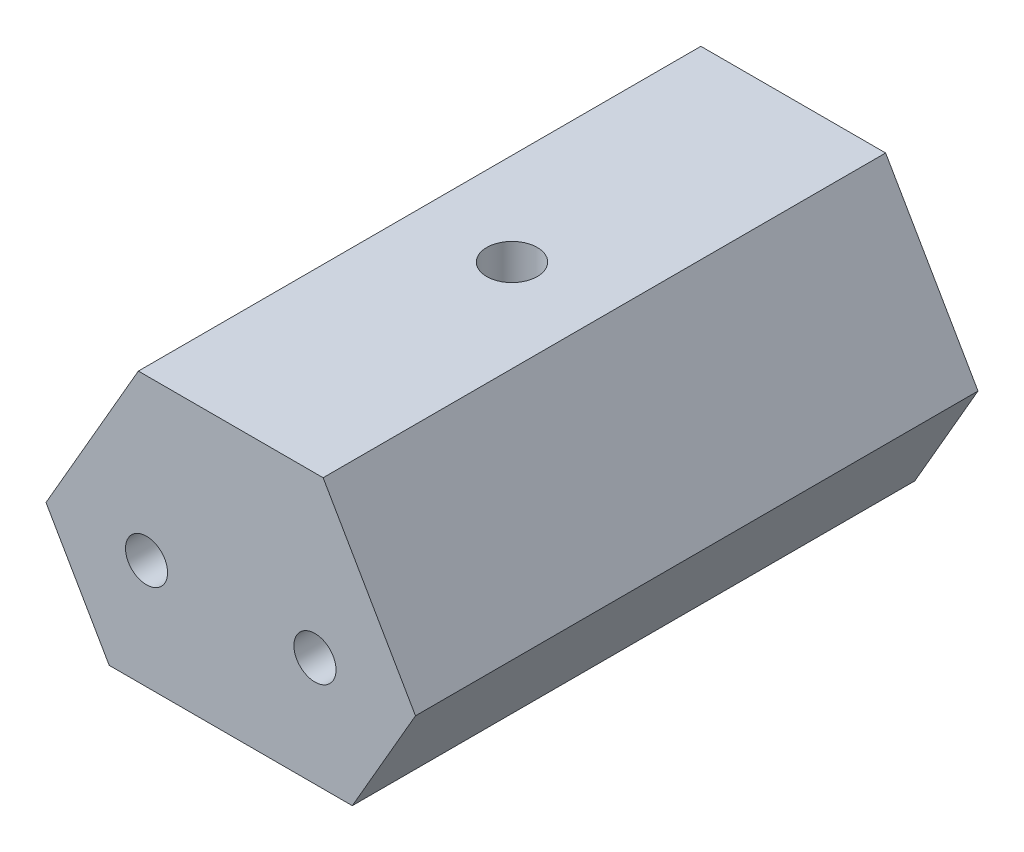
ISO-10303-21;
HEADER;
FILE_DESCRIPTION(('STEP AP214'),'2;1');
FILE_NAME('part.step','',(''),(''),'','','');
FILE_SCHEMA(('AUTOMOTIVE_DESIGN { 1 0 10303 214 1 1 1 1 }'));
ENDSEC;
DATA;
#1=APPLICATION_CONTEXT('core data for automotive mechanical design processes');
#2=APPLICATION_PROTOCOL_DEFINITION('international standard','automotive_design',2000,#1);
#3=PRODUCT_CONTEXT('',#1,'mechanical');
#4=PRODUCT('Part','Part','',(#3));
#5=PRODUCT_RELATED_PRODUCT_CATEGORY('part','',(#4));
#6=PRODUCT_DEFINITION_FORMATION('','',#4);
#7=PRODUCT_DEFINITION_CONTEXT('part definition',#1,'design');
#8=PRODUCT_DEFINITION('design','',#6,#7);
#9=PRODUCT_DEFINITION_SHAPE('','',#8);
#10=(LENGTH_UNIT() NAMED_UNIT(*) SI_UNIT(.MILLI.,.METRE.));
#11=(NAMED_UNIT(*) PLANE_ANGLE_UNIT() SI_UNIT($,.RADIAN.));
#12=(NAMED_UNIT(*) SI_UNIT($,.STERADIAN.) SOLID_ANGLE_UNIT());
#13=UNCERTAINTY_MEASURE_WITH_UNIT(LENGTH_MEASURE(1.E-05),#10,'distance_accuracy_value','');
#14=(GEOMETRIC_REPRESENTATION_CONTEXT(3) GLOBAL_UNCERTAINTY_ASSIGNED_CONTEXT((#13)) GLOBAL_UNIT_ASSIGNED_CONTEXT((#10,
#11,#12)) REPRESENTATION_CONTEXT('',''));
#15=CARTESIAN_POINT('',(0.,0.,0.));
#16=DIRECTION('',(0.,0.,1.));
#17=DIRECTION('',(1.,0.,0.));
#18=AXIS2_PLACEMENT_3D('',#15,#16,#17);
#19=CARTESIAN_POINT('',(5.48482755730145,9.5,16.7));
#20=DIRECTION('',(0.,-1.,0.));
#21=DIRECTION('',(1.,0.,0.));
#22=AXIS2_PLACEMENT_3D('',#19,#20,#21);
#23=PLANE('',#22);
#24=DIRECTION('',(-1.,0.,0.));
#25=VECTOR('',#24,1.);
#26=CARTESIAN_POINT('',(5.48482755730145,9.5,-16.7));
#27=LINE('',#26,#25);
#28=CARTESIAN_POINT('',(5.48482755730145,9.5,-16.7));
#29=VERTEX_POINT('',#28);
#30=CARTESIAN_POINT('',(-5.48482755730144,9.5,-16.7));
#31=VERTEX_POINT('',#30);
#32=EDGE_CURVE('E144',#29,#31,#27,.T.);
#33=ORIENTED_EDGE('',*,*,#32,.T.);
#34=DIRECTION('',(0.,0.,-1.));
#35=VECTOR('',#34,1.);
#36=CARTESIAN_POINT('',(-5.48482755730144,9.5,16.7));
#37=LINE('',#36,#35);
#38=CARTESIAN_POINT('',(-5.48482755730144,9.5,16.7));
#39=VERTEX_POINT('',#38);
#40=EDGE_CURVE('E59',#39,#31,#37,.T.);
#41=ORIENTED_EDGE('',*,*,#40,.F.);
#42=DIRECTION('',(-1.,0.,0.));
#43=VECTOR('',#42,1.);
#44=CARTESIAN_POINT('',(5.48482755730145,9.5,16.7));
#45=LINE('',#44,#43);
#46=CARTESIAN_POINT('',(5.48482755730145,9.5,16.7));
#47=VERTEX_POINT('',#46);
#48=EDGE_CURVE('E104',#47,#39,#45,.T.);
#49=ORIENTED_EDGE('',*,*,#48,.F.);
#50=DIRECTION('',(0.,0.,-1.));
#51=VECTOR('',#50,1.);
#52=CARTESIAN_POINT('',(5.48482755730145,9.5,16.7));
#53=LINE('',#52,#51);
#54=EDGE_CURVE('E11',#47,#29,#53,.T.);
#55=ORIENTED_EDGE('',*,*,#54,.T.);
#56=EDGE_LOOP('',(#33,#41,#49,#55));
#57=FACE_BOUND('',#56,.T.);
#58=CARTESIAN_POINT('',(0.,9.5,0.));
#59=DIRECTION('',(0.,1.,0.));
#60=DIRECTION('',(0.,0.,1.));
#61=AXIS2_PLACEMENT_3D('',#58,#59,#60);
#62=CIRCLE('',#61,1.5);
#63=CARTESIAN_POINT('',(0.,9.5,1.5));
#64=VERTEX_POINT('',#63);
#65=EDGE_CURVE('E281',#64,#64,#62,.T.);
#66=ORIENTED_EDGE('',*,*,#65,.F.);
#67=EDGE_LOOP('',(#66));
#68=FACE_BOUND('',#67,.T.);
#69=ADVANCED_FACE('F49',(#57,#68),#23,.F.);
#70=CARTESIAN_POINT('',(0.,0.,16.7));
#71=DIRECTION('',(0.,0.,1.));
#72=DIRECTION('',(1.,0.,0.));
#73=AXIS2_PLACEMENT_3D('',#70,#71,#72);
#74=PLANE('',#73);
#75=CARTESIAN_POINT('',(-5.,0.,16.7));
#76=DIRECTION('',(0.,0.,1.));
#77=DIRECTION('',(1.,0.,0.));
#78=AXIS2_PLACEMENT_3D('',#75,#76,#77);
#79=CIRCLE('',#78,1.25);
#80=CARTESIAN_POINT('',(-3.75,0.,16.7));
#81=VERTEX_POINT('',#80);
#82=EDGE_CURVE('E145',#81,#81,#79,.T.);
#83=ORIENTED_EDGE('',*,*,#82,.F.);
#84=EDGE_LOOP('',(#83));
#85=FACE_BOUND('',#84,.T.);
#86=DIRECTION('',(-0.5,0.866025403784439,0.));
#87=VECTOR('',#86,1.);
#88=CARTESIAN_POINT('',(10.9696551146029,0.,16.7));
#89=LINE('',#88,#87);
#90=CARTESIAN_POINT('',(10.9696551146029,0.,16.7));
#91=VERTEX_POINT('',#90);
#92=EDGE_CURVE('E157',#91,#47,#89,.T.);
#93=ORIENTED_EDGE('',*,*,#92,.T.);
#94=ORIENTED_EDGE('',*,*,#48,.T.);
#95=DIRECTION('',(-0.5,-0.866025403784439,0.));
#96=VECTOR('',#95,1.);
#97=CARTESIAN_POINT('',(-5.48482755730144,9.5,16.7));
#98=LINE('',#97,#96);
#99=CARTESIAN_POINT('',(-10.9696551146029,0.,16.7));
#100=VERTEX_POINT('',#99);
#101=EDGE_CURVE('E118',#39,#100,#98,.T.);
#102=ORIENTED_EDGE('',*,*,#101,.T.);
#103=DIRECTION('',(0.5,-0.866025403784439,0.));
#104=VECTOR('',#103,1.);
#105=CARTESIAN_POINT('',(-10.9696551146029,0.,16.7));
#106=LINE('',#105,#104);
#107=CARTESIAN_POINT('',(-7.21687836487032,-6.5,16.7));
#108=VERTEX_POINT('',#107);
#109=EDGE_CURVE('E111',#100,#108,#106,.T.);
#110=ORIENTED_EDGE('',*,*,#109,.T.);
#111=DIRECTION('',(1.,0.,0.));
#112=VECTOR('',#111,1.);
#113=CARTESIAN_POINT('',(-7.21687836487032,-6.5,16.7));
#114=LINE('',#113,#112);
#115=CARTESIAN_POINT('',(7.21687836487032,-6.5,16.7));
#116=VERTEX_POINT('',#115);
#117=EDGE_CURVE('E116',#108,#116,#114,.T.);
#118=ORIENTED_EDGE('',*,*,#117,.T.);
#119=DIRECTION('',(0.5,0.866025403784438,0.));
#120=VECTOR('',#119,1.);
#121=CARTESIAN_POINT('',(7.21687836487032,-6.5,16.7));
#122=LINE('',#121,#120);
#123=EDGE_CURVE('E67',#116,#91,#122,.T.);
#124=ORIENTED_EDGE('',*,*,#123,.T.);
#125=EDGE_LOOP('',(#93,#94,#102,#110,#118,#124));
#126=FACE_BOUND('',#125,.T.);
#127=CARTESIAN_POINT('',(5.,0.,16.7));
#128=DIRECTION('',(0.,0.,1.));
#129=DIRECTION('',(1.,0.,0.));
#130=AXIS2_PLACEMENT_3D('',#127,#128,#129);
#131=CIRCLE('',#130,1.25);
#132=CARTESIAN_POINT('',(6.25,0.,16.7));
#133=VERTEX_POINT('',#132);
#134=EDGE_CURVE('E288',#133,#133,#131,.T.);
#135=ORIENTED_EDGE('',*,*,#134,.F.);
#136=EDGE_LOOP('',(#135));
#137=FACE_BOUND('',#136,.T.);
#138=ADVANCED_FACE('F113',(#85,#126,#137),#74,.T.);
#139=CARTESIAN_POINT('',(0.,0.,-16.7));
#140=DIRECTION('',(0.,0.,1.));
#141=DIRECTION('',(1.,0.,0.));
#142=AXIS2_PLACEMENT_3D('',#139,#140,#141);
#143=PLANE('',#142);
#144=DIRECTION('',(-0.5,0.866025403784439,0.));
#145=VECTOR('',#144,1.);
#146=CARTESIAN_POINT('',(10.9696551146029,0.,-16.7));
#147=LINE('',#146,#145);
#148=CARTESIAN_POINT('',(10.9696551146029,0.,-16.7));
#149=VERTEX_POINT('',#148);
#150=EDGE_CURVE('E140',#149,#29,#147,.T.);
#151=ORIENTED_EDGE('',*,*,#150,.F.);
#152=DIRECTION('',(0.5,0.866025403784438,0.));
#153=VECTOR('',#152,1.);
#154=CARTESIAN_POINT('',(7.21687836487032,-6.5,-16.7));
#155=LINE('',#154,#153);
#156=CARTESIAN_POINT('',(7.21687836487032,-6.5,-16.7));
#157=VERTEX_POINT('',#156);
#158=EDGE_CURVE('E96',#157,#149,#155,.T.);
#159=ORIENTED_EDGE('',*,*,#158,.F.);
#160=DIRECTION('',(1.,0.,0.));
#161=VECTOR('',#160,1.);
#162=CARTESIAN_POINT('',(-7.21687836487032,-6.5,-16.7));
#163=LINE('',#162,#161);
#164=CARTESIAN_POINT('',(-7.21687836487032,-6.5,-16.7));
#165=VERTEX_POINT('',#164);
#166=EDGE_CURVE('E90',#165,#157,#163,.T.);
#167=ORIENTED_EDGE('',*,*,#166,.F.);
#168=DIRECTION('',(0.5,-0.866025403784439,0.));
#169=VECTOR('',#168,1.);
#170=CARTESIAN_POINT('',(-10.9696551146029,0.,-16.7));
#171=LINE('',#170,#169);
#172=CARTESIAN_POINT('',(-10.9696551146029,0.,-16.7));
#173=VERTEX_POINT('',#172);
#174=EDGE_CURVE('E127',#173,#165,#171,.T.);
#175=ORIENTED_EDGE('',*,*,#174,.F.);
#176=DIRECTION('',(-0.5,-0.866025403784439,0.));
#177=VECTOR('',#176,1.);
#178=CARTESIAN_POINT('',(-5.48482755730144,9.5,-16.7));
#179=LINE('',#178,#177);
#180=EDGE_CURVE('E148',#31,#173,#179,.T.);
#181=ORIENTED_EDGE('',*,*,#180,.F.);
#182=ORIENTED_EDGE('',*,*,#32,.F.);
#183=EDGE_LOOP('',(#151,#159,#167,#175,#181,#182));
#184=FACE_BOUND('',#183,.T.);
#185=CARTESIAN_POINT('',(-5.,0.,-16.7));
#186=DIRECTION('',(0.,0.,1.));
#187=DIRECTION('',(1.,0.,0.));
#188=AXIS2_PLACEMENT_3D('',#185,#186,#187);
#189=CIRCLE('',#188,1.25);
#190=CARTESIAN_POINT('',(-3.75,0.,-16.7));
#191=VERTEX_POINT('',#190);
#192=EDGE_CURVE('E292',#191,#191,#189,.T.);
#193=ORIENTED_EDGE('',*,*,#192,.T.);
#194=EDGE_LOOP('',(#193));
#195=FACE_BOUND('',#194,.T.);
#196=CARTESIAN_POINT('',(5.,0.,-16.7));
#197=DIRECTION('',(0.,0.,1.));
#198=DIRECTION('',(1.,0.,0.));
#199=AXIS2_PLACEMENT_3D('',#196,#197,#198);
#200=CIRCLE('',#199,1.25);
#201=CARTESIAN_POINT('',(6.25,0.,-16.7));
#202=VERTEX_POINT('',#201);
#203=EDGE_CURVE('E285',#202,#202,#200,.T.);
#204=ORIENTED_EDGE('',*,*,#203,.T.);
#205=EDGE_LOOP('',(#204));
#206=FACE_BOUND('',#205,.T.);
#207=ADVANCED_FACE('F170',(#184,#195,#206),#143,.F.);
#208=CARTESIAN_POINT('',(10.9696551146029,0.,16.7));
#209=DIRECTION('',(-0.866025403784439,-0.5,0.));
#210=DIRECTION('',(0.5,-0.866025403784439,0.));
#211=AXIS2_PLACEMENT_3D('',#208,#209,#210);
#212=PLANE('',#211);
#213=ORIENTED_EDGE('',*,*,#150,.T.);
#214=ORIENTED_EDGE('',*,*,#54,.F.);
#215=ORIENTED_EDGE('',*,*,#92,.F.);
#216=DIRECTION('',(0.,0.,-1.));
#217=VECTOR('',#216,1.);
#218=CARTESIAN_POINT('',(10.9696551146029,0.,16.7));
#219=LINE('',#218,#217);
#220=EDGE_CURVE('E136',#91,#149,#219,.T.);
#221=ORIENTED_EDGE('',*,*,#220,.T.);
#222=EDGE_LOOP('',(#213,#214,#215,#221));
#223=FACE_BOUND('',#222,.T.);
#224=ADVANCED_FACE('F51',(#223),#212,.F.);
#225=CARTESIAN_POINT('',(-5.48482755730144,9.5,16.7));
#226=DIRECTION('',(0.866025403784439,-0.5,0.));
#227=DIRECTION('',(0.5,0.866025403784439,0.));
#228=AXIS2_PLACEMENT_3D('',#225,#226,#227);
#229=PLANE('',#228);
#230=ORIENTED_EDGE('',*,*,#180,.T.);
#231=DIRECTION('',(0.,0.,-1.));
#232=VECTOR('',#231,1.);
#233=CARTESIAN_POINT('',(-10.9696551146029,0.,16.7));
#234=LINE('',#233,#232);
#235=EDGE_CURVE('E129',#100,#173,#234,.T.);
#236=ORIENTED_EDGE('',*,*,#235,.F.);
#237=ORIENTED_EDGE('',*,*,#101,.F.);
#238=ORIENTED_EDGE('',*,*,#40,.T.);
#239=EDGE_LOOP('',(#230,#236,#237,#238));
#240=FACE_BOUND('',#239,.T.);
#241=ADVANCED_FACE('F167',(#240),#229,.F.);
#242=CARTESIAN_POINT('',(-10.9696551146029,0.,16.7));
#243=DIRECTION('',(0.866025403784439,0.5,0.));
#244=DIRECTION('',(-0.5,0.866025403784439,0.));
#245=AXIS2_PLACEMENT_3D('',#242,#243,#244);
#246=PLANE('',#245);
#247=ORIENTED_EDGE('',*,*,#174,.T.);
#248=DIRECTION('',(0.,0.,-1.));
#249=VECTOR('',#248,1.);
#250=CARTESIAN_POINT('',(-7.21687836487032,-6.5,16.7));
#251=LINE('',#250,#249);
#252=EDGE_CURVE('E124',#108,#165,#251,.T.);
#253=ORIENTED_EDGE('',*,*,#252,.F.);
#254=ORIENTED_EDGE('',*,*,#109,.F.);
#255=ORIENTED_EDGE('',*,*,#235,.T.);
#256=EDGE_LOOP('',(#247,#253,#254,#255));
#257=FACE_BOUND('',#256,.T.);
#258=ADVANCED_FACE('F125',(#257),#246,.F.);
#259=CARTESIAN_POINT('',(-7.21687836487032,-6.5,16.7));
#260=DIRECTION('',(0.,1.,0.));
#261=DIRECTION('',(0.,0.,1.));
#262=AXIS2_PLACEMENT_3D('',#259,#260,#261);
#263=PLANE('',#262);
#264=CARTESIAN_POINT('',(0.,-6.5,0.));
#265=DIRECTION('',(0.,1.,0.));
#266=DIRECTION('',(0.,0.,1.));
#267=AXIS2_PLACEMENT_3D('',#264,#265,#266);
#268=CIRCLE('',#267,1.5);
#269=CARTESIAN_POINT('',(0.,-6.5,1.5));
#270=VERTEX_POINT('',#269);
#271=EDGE_CURVE('E278',#270,#270,#268,.T.);
#272=ORIENTED_EDGE('',*,*,#271,.T.);
#273=EDGE_LOOP('',(#272));
#274=FACE_BOUND('',#273,.T.);
#275=ORIENTED_EDGE('',*,*,#166,.T.);
#276=DIRECTION('',(0.,0.,-1.));
#277=VECTOR('',#276,1.);
#278=CARTESIAN_POINT('',(7.21687836487032,-6.5,16.7));
#279=LINE('',#278,#277);
#280=EDGE_CURVE('E130',#116,#157,#279,.T.);
#281=ORIENTED_EDGE('',*,*,#280,.F.);
#282=ORIENTED_EDGE('',*,*,#117,.F.);
#283=ORIENTED_EDGE('',*,*,#252,.T.);
#284=EDGE_LOOP('',(#275,#281,#282,#283));
#285=FACE_BOUND('',#284,.T.);
#286=ADVANCED_FACE('F132',(#274,#285),#263,.F.);
#287=CARTESIAN_POINT('',(7.21687836487032,-6.5,16.7));
#288=DIRECTION('',(-0.866025403784438,0.5,0.));
#289=DIRECTION('',(-0.5,-0.866025403784439,0.));
#290=AXIS2_PLACEMENT_3D('',#287,#288,#289);
#291=PLANE('',#290);
#292=ORIENTED_EDGE('',*,*,#158,.T.);
#293=ORIENTED_EDGE('',*,*,#220,.F.);
#294=ORIENTED_EDGE('',*,*,#123,.F.);
#295=ORIENTED_EDGE('',*,*,#280,.T.);
#296=EDGE_LOOP('',(#292,#293,#294,#295));
#297=FACE_BOUND('',#296,.T.);
#298=ADVANCED_FACE('F175',(#297),#291,.F.);
#299=CARTESIAN_POINT('',(-5.,0.,16.7));
#300=DIRECTION('',(0.,0.,-1.));
#301=DIRECTION('',(-1.,0.,0.));
#302=AXIS2_PLACEMENT_3D('',#299,#300,#301);
#303=CYLINDRICAL_SURFACE('',#302,1.25);
#304=ORIENTED_EDGE('',*,*,#82,.T.);
#305=EDGE_LOOP('',(#304));
#306=FACE_BOUND('',#305,.T.);
#307=ORIENTED_EDGE('',*,*,#192,.F.);
#308=EDGE_LOOP('',(#307));
#309=FACE_BOUND('',#308,.T.);
#310=ADVANCED_FACE('F177',(#306,#309),#303,.F.);
#311=CARTESIAN_POINT('',(5.,0.,16.7));
#312=DIRECTION('',(0.,0.,-1.));
#313=DIRECTION('',(-1.,0.,0.));
#314=AXIS2_PLACEMENT_3D('',#311,#312,#313);
#315=CYLINDRICAL_SURFACE('',#314,1.25);
#316=ORIENTED_EDGE('',*,*,#134,.T.);
#317=EDGE_LOOP('',(#316));
#318=FACE_BOUND('',#317,.T.);
#319=ORIENTED_EDGE('',*,*,#203,.F.);
#320=EDGE_LOOP('',(#319));
#321=FACE_BOUND('',#320,.T.);
#322=ADVANCED_FACE('F183',(#318,#321),#315,.F.);
#323=CARTESIAN_POINT('',(0.,9.5,0.));
#324=DIRECTION('',(0.,1.,0.));
#325=DIRECTION('',(0.,0.,1.));
#326=AXIS2_PLACEMENT_3D('',#323,#324,#325);
#327=CYLINDRICAL_SURFACE('',#326,1.5);
#328=ORIENTED_EDGE('',*,*,#271,.F.);
#329=EDGE_LOOP('',(#328));
#330=FACE_BOUND('',#329,.T.);
#331=ORIENTED_EDGE('',*,*,#65,.T.);
#332=EDGE_LOOP('',(#331));
#333=FACE_BOUND('',#332,.T.);
#334=ADVANCED_FACE('F252',(#330,#333),#327,.F.);
#335=CLOSED_SHELL('',(#69,#138,#207,#224,#241,#258,#286,#298,#310,#322,#334));
#336=MANIFOLD_SOLID_BREP('B2',#335);
#337=ADVANCED_BREP_SHAPE_REPRESENTATION('',(#18,#336),#14);
#338=SHAPE_DEFINITION_REPRESENTATION(#9,#337);
ENDSEC;
END-ISO-10303-21;
